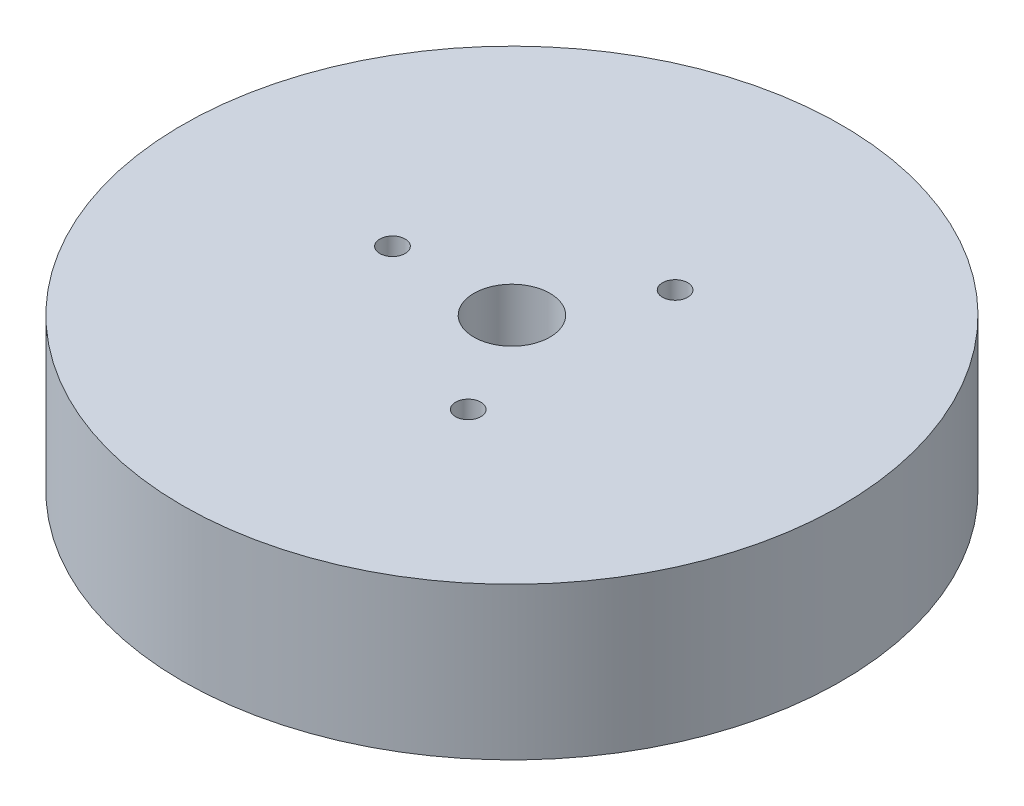
ISO-10303-21;
HEADER;
FILE_DESCRIPTION(('STEP AP214'),'2;1');
FILE_NAME('part.step','',(''),(''),'','','');
FILE_SCHEMA(('AUTOMOTIVE_DESIGN { 1 0 10303 214 1 1 1 1 }'));
ENDSEC;
DATA;
#1=APPLICATION_CONTEXT('core data for automotive mechanical design processes');
#2=APPLICATION_PROTOCOL_DEFINITION('international standard','automotive_design',2000,#1);
#3=PRODUCT_CONTEXT('',#1,'mechanical');
#4=PRODUCT('Part','Part','',(#3));
#5=PRODUCT_RELATED_PRODUCT_CATEGORY('part','',(#4));
#6=PRODUCT_DEFINITION_FORMATION('','',#4);
#7=PRODUCT_DEFINITION_CONTEXT('part definition',#1,'design');
#8=PRODUCT_DEFINITION('design','',#6,#7);
#9=PRODUCT_DEFINITION_SHAPE('','',#8);
#10=(LENGTH_UNIT() NAMED_UNIT(*) SI_UNIT(.MILLI.,.METRE.));
#11=(NAMED_UNIT(*) PLANE_ANGLE_UNIT() SI_UNIT($,.RADIAN.));
#12=(NAMED_UNIT(*) SI_UNIT($,.STERADIAN.) SOLID_ANGLE_UNIT());
#13=UNCERTAINTY_MEASURE_WITH_UNIT(LENGTH_MEASURE(1.E-05),#10,'distance_accuracy_value','');
#14=(GEOMETRIC_REPRESENTATION_CONTEXT(3) GLOBAL_UNCERTAINTY_ASSIGNED_CONTEXT((#13)) GLOBAL_UNIT_ASSIGNED_CONTEXT((#10,
#11,#12)) REPRESENTATION_CONTEXT('',''));
#15=CARTESIAN_POINT('',(0.,0.,0.));
#16=DIRECTION('',(0.,0.,1.));
#17=DIRECTION('',(1.,0.,0.));
#18=AXIS2_PLACEMENT_3D('',#15,#16,#17);
#19=CARTESIAN_POINT('',(0.,30.,0.));
#20=DIRECTION('',(0.,-1.,0.));
#21=DIRECTION('',(0.,0.,-1.));
#22=AXIS2_PLACEMENT_3D('',#19,#20,#21);
#23=CYLINDRICAL_SURFACE('',#22,65.);
#24=CARTESIAN_POINT('',(0.,30.,0.));
#25=DIRECTION('',(0.,1.,0.));
#26=DIRECTION('',(0.,0.,1.));
#27=AXIS2_PLACEMENT_3D('',#24,#25,#26);
#28=CIRCLE('',#27,65.);
#29=CARTESIAN_POINT('',(0.,30.,65.));
#30=VERTEX_POINT('',#29);
#31=EDGE_CURVE('E10',#30,#30,#28,.T.);
#32=ORIENTED_EDGE('',*,*,#31,.F.);
#33=EDGE_LOOP('',(#32));
#34=FACE_BOUND('',#33,.T.);
#35=CARTESIAN_POINT('',(0.,0.,0.));
#36=DIRECTION('',(0.,1.,0.));
#37=DIRECTION('',(0.,0.,1.));
#38=AXIS2_PLACEMENT_3D('',#35,#36,#37);
#39=CIRCLE('',#38,65.);
#40=CARTESIAN_POINT('',(0.,0.,65.));
#41=VERTEX_POINT('',#40);
#42=EDGE_CURVE('E37',#41,#41,#39,.T.);
#43=ORIENTED_EDGE('',*,*,#42,.T.);
#44=EDGE_LOOP('',(#43));
#45=FACE_BOUND('',#44,.T.);
#46=ADVANCED_FACE('F40',(#34,#45),#23,.T.);
#47=CARTESIAN_POINT('',(0.,30.,0.));
#48=DIRECTION('',(0.,1.,0.));
#49=DIRECTION('',(0.,0.,1.));
#50=AXIS2_PLACEMENT_3D('',#47,#48,#49);
#51=PLANE('',#50);
#52=CARTESIAN_POINT('',(11.7781753510731,30.,20.4003981285138));
#53=DIRECTION('',(0.,1.,0.));
#54=DIRECTION('',(0.866025403784436,0.,-0.500000000000004));
#55=AXIS2_PLACEMENT_3D('',#52,#53,#54);
#56=CIRCLE('',#55,2.49132842694762);
#57=CARTESIAN_POINT('',(13.9357290579801,30.,19.15473391504));
#58=VERTEX_POINT('',#57);
#59=EDGE_CURVE('E70',#58,#58,#56,.T.);
#60=ORIENTED_EDGE('',*,*,#59,.F.);
#61=EDGE_LOOP('',(#60));
#62=FACE_BOUND('',#61,.T.);
#63=CARTESIAN_POINT('',(11.7781753510728,30.,-20.4003981285139));
#64=DIRECTION('',(0.,1.,0.));
#65=DIRECTION('',(-0.866025403784443,0.,-0.499999999999992));
#66=AXIS2_PLACEMENT_3D('',#63,#64,#65);
#67=CIRCLE('',#66,2.49132842694762);
#68=CARTESIAN_POINT('',(9.62062164416584,30.,-21.6460623419877));
#69=VERTEX_POINT('',#68);
#70=EDGE_CURVE('E61',#69,#69,#67,.T.);
#71=ORIENTED_EDGE('',*,*,#70,.F.);
#72=EDGE_LOOP('',(#71));
#73=FACE_BOUND('',#72,.T.);
#74=CARTESIAN_POINT('',(-23.556350702146,30.,0.));
#75=DIRECTION('',(0.,1.,0.));
#76=DIRECTION('',(0.,0.,1.));
#77=AXIS2_PLACEMENT_3D('',#74,#75,#76);
#78=CIRCLE('',#77,2.49132842694762);
#79=CARTESIAN_POINT('',(-23.556350702146,30.,2.49132842694762));
#80=VERTEX_POINT('',#79);
#81=EDGE_CURVE('E54',#80,#80,#78,.T.);
#82=ORIENTED_EDGE('',*,*,#81,.F.);
#83=EDGE_LOOP('',(#82));
#84=FACE_BOUND('',#83,.T.);
#85=CARTESIAN_POINT('',(0.,30.,0.));
#86=DIRECTION('',(0.,1.,0.));
#87=DIRECTION('',(0.,0.,1.));
#88=AXIS2_PLACEMENT_3D('',#85,#86,#87);
#89=CIRCLE('',#88,7.5);
#90=CARTESIAN_POINT('',(0.,30.,7.5));
#91=VERTEX_POINT('',#90);
#92=EDGE_CURVE('E50',#91,#91,#89,.T.);
#93=ORIENTED_EDGE('',*,*,#92,.F.);
#94=EDGE_LOOP('',(#93));
#95=FACE_BOUND('',#94,.T.);
#96=ORIENTED_EDGE('',*,*,#31,.T.);
#97=EDGE_LOOP('',(#96));
#98=FACE_BOUND('',#97,.T.);
#99=ADVANCED_FACE('F85',(#62,#73,#84,#95,#98),#51,.T.);
#100=CARTESIAN_POINT('',(0.,0.,0.));
#101=DIRECTION('',(0.,1.,0.));
#102=DIRECTION('',(0.,0.,1.));
#103=AXIS2_PLACEMENT_3D('',#100,#101,#102);
#104=PLANE('',#103);
#105=CARTESIAN_POINT('',(0.,0.,0.));
#106=DIRECTION('',(0.,1.,0.));
#107=DIRECTION('',(0.,0.,1.));
#108=AXIS2_PLACEMENT_3D('',#105,#106,#107);
#109=CIRCLE('',#108,7.5);
#110=CARTESIAN_POINT('',(0.,0.,7.5));
#111=VERTEX_POINT('',#110);
#112=EDGE_CURVE('E47',#111,#111,#109,.T.);
#113=ORIENTED_EDGE('',*,*,#112,.T.);
#114=EDGE_LOOP('',(#113));
#115=FACE_BOUND('',#114,.T.);
#116=ORIENTED_EDGE('',*,*,#42,.F.);
#117=EDGE_LOOP('',(#116));
#118=FACE_BOUND('',#117,.T.);
#119=ADVANCED_FACE('F84',(#115,#118),#104,.F.);
#120=CARTESIAN_POINT('',(0.,30.,0.));
#121=DIRECTION('',(0.,-1.,0.));
#122=DIRECTION('',(0.,0.,-1.));
#123=AXIS2_PLACEMENT_3D('',#120,#121,#122);
#124=CYLINDRICAL_SURFACE('',#123,7.5);
#125=ORIENTED_EDGE('',*,*,#92,.T.);
#126=EDGE_LOOP('',(#125));
#127=FACE_BOUND('',#126,.T.);
#128=ORIENTED_EDGE('',*,*,#112,.F.);
#129=EDGE_LOOP('',(#128));
#130=FACE_BOUND('',#129,.T.);
#131=ADVANCED_FACE('F91',(#127,#130),#124,.F.);
#132=CARTESIAN_POINT('',(-23.556350702146,2.61934132943557,0.));
#133=DIRECTION('',(0.,1.,0.));
#134=DIRECTION('',(0.,0.,1.));
#135=AXIS2_PLACEMENT_3D('',#132,#133,#134);
#136=CYLINDRICAL_SURFACE('',#135,2.49132842694762);
#137=CARTESIAN_POINT('',(-23.556350702146,2.61934132943557,0.));
#138=DIRECTION('',(0.,1.,0.));
#139=DIRECTION('',(0.,0.,1.));
#140=AXIS2_PLACEMENT_3D('',#137,#138,#139);
#141=CIRCLE('',#140,2.49132842694762);
#142=CARTESIAN_POINT('',(-23.556350702146,2.61934132943557,2.49132842694762));
#143=VERTEX_POINT('',#142);
#144=EDGE_CURVE('E55',#143,#143,#141,.T.);
#145=ORIENTED_EDGE('',*,*,#144,.F.);
#146=EDGE_LOOP('',(#145));
#147=FACE_BOUND('',#146,.T.);
#148=ORIENTED_EDGE('',*,*,#81,.T.);
#149=EDGE_LOOP('',(#148));
#150=FACE_BOUND('',#149,.T.);
#151=ADVANCED_FACE('F96',(#147,#150),#136,.F.);
#152=CARTESIAN_POINT('',(-23.556350702146,2.61934132943557,0.));
#153=DIRECTION('',(0.,1.,0.));
#154=DIRECTION('',(0.,0.,1.));
#155=AXIS2_PLACEMENT_3D('',#152,#153,#154);
#156=PLANE('',#155);
#157=ORIENTED_EDGE('',*,*,#144,.T.);
#158=EDGE_LOOP('',(#157));
#159=FACE_BOUND('',#158,.T.);
#160=ADVANCED_FACE('F127',(#159),#156,.T.);
#161=CARTESIAN_POINT('',(11.7781753510728,2.61934132943557,-20.4003981285139));
#162=DIRECTION('',(0.,1.,0.));
#163=DIRECTION('',(0.,0.,1.));
#164=AXIS2_PLACEMENT_3D('',#161,#162,#163);
#165=CYLINDRICAL_SURFACE('',#164,2.49132842694762);
#166=CARTESIAN_POINT('',(11.7781753510728,2.61934132943557,-20.4003981285139));
#167=DIRECTION('',(0.,1.,0.));
#168=DIRECTION('',(-0.866025403784443,0.,-0.499999999999992));
#169=AXIS2_PLACEMENT_3D('',#166,#167,#168);
#170=CIRCLE('',#169,2.49132842694762);
#171=CARTESIAN_POINT('',(9.62062164416584,2.61934132943557,-21.6460623419877));
#172=VERTEX_POINT('',#171);
#173=EDGE_CURVE('E63',#172,#172,#170,.T.);
#174=ORIENTED_EDGE('',*,*,#173,.F.);
#175=EDGE_LOOP('',(#174));
#176=FACE_BOUND('',#175,.T.);
#177=ORIENTED_EDGE('',*,*,#70,.T.);
#178=EDGE_LOOP('',(#177));
#179=FACE_BOUND('',#178,.T.);
#180=ADVANCED_FACE('F133',(#176,#179),#165,.F.);
#181=CARTESIAN_POINT('',(11.7781753510728,2.61934132943557,-20.4003981285139));
#182=DIRECTION('',(0.,1.,0.));
#183=DIRECTION('',(-0.866025403784443,0.,-0.499999999999992));
#184=AXIS2_PLACEMENT_3D('',#181,#182,#183);
#185=PLANE('',#184);
#186=ORIENTED_EDGE('',*,*,#173,.T.);
#187=EDGE_LOOP('',(#186));
#188=FACE_BOUND('',#187,.T.);
#189=ADVANCED_FACE('F77',(#188),#185,.T.);
#190=CARTESIAN_POINT('',(11.7781753510731,2.61934132943557,20.4003981285138));
#191=DIRECTION('',(0.,1.,0.));
#192=DIRECTION('',(0.,0.,1.));
#193=AXIS2_PLACEMENT_3D('',#190,#191,#192);
#194=CYLINDRICAL_SURFACE('',#193,2.49132842694762);
#195=CARTESIAN_POINT('',(11.7781753510731,2.61934132943557,20.4003981285138));
#196=DIRECTION('',(0.,1.,0.));
#197=DIRECTION('',(0.866025403784436,0.,-0.500000000000004));
#198=AXIS2_PLACEMENT_3D('',#195,#196,#197);
#199=CIRCLE('',#198,2.49132842694762);
#200=CARTESIAN_POINT('',(13.9357290579801,2.61934132943557,19.15473391504));
#201=VERTEX_POINT('',#200);
#202=EDGE_CURVE('E59',#201,#201,#199,.T.);
#203=ORIENTED_EDGE('',*,*,#202,.F.);
#204=EDGE_LOOP('',(#203));
#205=FACE_BOUND('',#204,.T.);
#206=ORIENTED_EDGE('',*,*,#59,.T.);
#207=EDGE_LOOP('',(#206));
#208=FACE_BOUND('',#207,.T.);
#209=ADVANCED_FACE('F73',(#205,#208),#194,.F.);
#210=CARTESIAN_POINT('',(11.7781753510731,2.61934132943557,20.4003981285138));
#211=DIRECTION('',(0.,1.,0.));
#212=DIRECTION('',(0.866025403784436,0.,-0.500000000000004));
#213=AXIS2_PLACEMENT_3D('',#210,#211,#212);
#214=PLANE('',#213);
#215=ORIENTED_EDGE('',*,*,#202,.T.);
#216=EDGE_LOOP('',(#215));
#217=FACE_BOUND('',#216,.T.);
#218=ADVANCED_FACE('F71',(#217),#214,.T.);
#219=CLOSED_SHELL('',(#46,#99,#119,#131,#151,#160,#180,#189,#209,#218));
#220=MANIFOLD_SOLID_BREP('B2',#219);
#221=ADVANCED_BREP_SHAPE_REPRESENTATION('',(#18,#220),#14);
#222=SHAPE_DEFINITION_REPRESENTATION(#9,#221);
ENDSEC;
END-ISO-10303-21;
